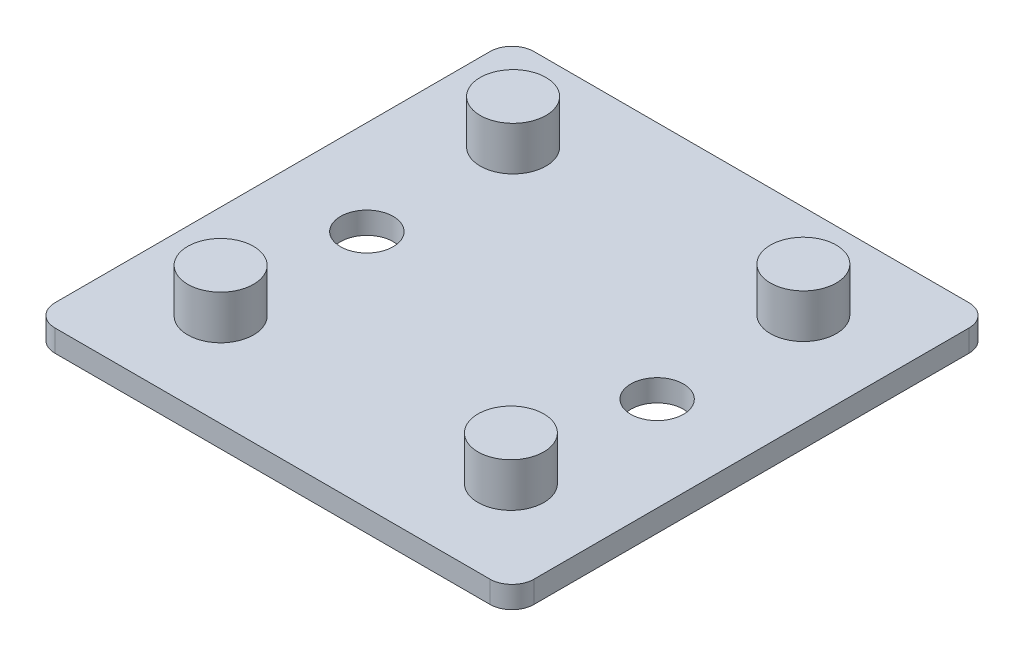
ISO-10303-21;
HEADER;
FILE_DESCRIPTION(('STEP AP214'),'2;1');
FILE_NAME('part.step','',(''),(''),'','','');
FILE_SCHEMA(('AUTOMOTIVE_DESIGN { 1 0 10303 214 1 1 1 1 }'));
ENDSEC;
DATA;
#1=APPLICATION_CONTEXT('core data for automotive mechanical design processes');
#2=APPLICATION_PROTOCOL_DEFINITION('international standard','automotive_design',2000,#1);
#3=PRODUCT_CONTEXT('',#1,'mechanical');
#4=PRODUCT('Part','Part','',(#3));
#5=PRODUCT_RELATED_PRODUCT_CATEGORY('part','',(#4));
#6=PRODUCT_DEFINITION_FORMATION('','',#4);
#7=PRODUCT_DEFINITION_CONTEXT('part definition',#1,'design');
#8=PRODUCT_DEFINITION('design','',#6,#7);
#9=PRODUCT_DEFINITION_SHAPE('','',#8);
#10=(LENGTH_UNIT() NAMED_UNIT(*) SI_UNIT(.MILLI.,.METRE.));
#11=(NAMED_UNIT(*) PLANE_ANGLE_UNIT() SI_UNIT($,.RADIAN.));
#12=(NAMED_UNIT(*) SI_UNIT($,.STERADIAN.) SOLID_ANGLE_UNIT());
#13=UNCERTAINTY_MEASURE_WITH_UNIT(LENGTH_MEASURE(1.E-05),#10,'distance_accuracy_value','');
#14=(GEOMETRIC_REPRESENTATION_CONTEXT(3) GLOBAL_UNCERTAINTY_ASSIGNED_CONTEXT((#13)) GLOBAL_UNIT_ASSIGNED_CONTEXT((#10,
#11,#12)) REPRESENTATION_CONTEXT('',''));
#15=CARTESIAN_POINT('',(0.,0.,0.));
#16=DIRECTION('',(0.,0.,1.));
#17=DIRECTION('',(1.,0.,0.));
#18=AXIS2_PLACEMENT_3D('',#15,#16,#17);
#19=CARTESIAN_POINT('',(-32.75,3.,32.75));
#20=DIRECTION('',(1.,0.,0.));
#21=DIRECTION('',(0.,0.,-1.));
#22=AXIS2_PLACEMENT_3D('',#19,#20,#21);
#23=PLANE('',#22);
#24=DIRECTION('',(0.,0.,1.));
#25=VECTOR('',#24,1.);
#26=CARTESIAN_POINT('',(-32.75,3.,32.75));
#27=LINE('',#26,#25);
#28=CARTESIAN_POINT('',(-32.75,3.,-29.75));
#29=VERTEX_POINT('',#28);
#30=CARTESIAN_POINT('',(-32.75,3.,29.75));
#31=VERTEX_POINT('',#30);
#32=EDGE_CURVE('E128',#29,#31,#27,.T.);
#33=ORIENTED_EDGE('',*,*,#32,.F.);
#34=DIRECTION('',(0.,-1.,0.));
#35=VECTOR('',#34,1.);
#36=CARTESIAN_POINT('',(-32.75,3.,-29.75));
#37=LINE('',#36,#35);
#38=CARTESIAN_POINT('',(-32.75,0.,-29.75));
#39=VERTEX_POINT('',#38);
#40=EDGE_CURVE('E112',#29,#39,#37,.T.);
#41=ORIENTED_EDGE('',*,*,#40,.T.);
#42=DIRECTION('',(0.,0.,1.));
#43=VECTOR('',#42,1.);
#44=CARTESIAN_POINT('',(-32.75,0.,32.75));
#45=LINE('',#44,#43);
#46=CARTESIAN_POINT('',(-32.75,0.,29.75));
#47=VERTEX_POINT('',#46);
#48=EDGE_CURVE('E125',#39,#47,#45,.T.);
#49=ORIENTED_EDGE('',*,*,#48,.T.);
#50=DIRECTION('',(0.,-1.,0.));
#51=VECTOR('',#50,1.);
#52=CARTESIAN_POINT('',(-32.75,3.,29.75));
#53=LINE('',#52,#51);
#54=EDGE_CURVE('E131',#47,#31,#53,.F.);
#55=ORIENTED_EDGE('',*,*,#54,.T.);
#56=EDGE_LOOP('',(#33,#41,#49,#55));
#57=FACE_BOUND('',#56,.T.);
#58=ADVANCED_FACE('F38',(#57),#23,.F.);
#59=CARTESIAN_POINT('',(32.75,3.,32.75));
#60=DIRECTION('',(0.,0.,-1.));
#61=DIRECTION('',(-1.,0.,0.));
#62=AXIS2_PLACEMENT_3D('',#59,#60,#61);
#63=PLANE('',#62);
#64=DIRECTION('',(1.,0.,0.));
#65=VECTOR('',#64,1.);
#66=CARTESIAN_POINT('',(32.75,3.,32.75));
#67=LINE('',#66,#65);
#68=CARTESIAN_POINT('',(-29.75,3.,32.75));
#69=VERTEX_POINT('',#68);
#70=CARTESIAN_POINT('',(29.75,3.,32.75));
#71=VERTEX_POINT('',#70);
#72=EDGE_CURVE('E214',#69,#71,#67,.T.);
#73=ORIENTED_EDGE('',*,*,#72,.F.);
#74=DIRECTION('',(0.,-1.,0.));
#75=VECTOR('',#74,1.);
#76=CARTESIAN_POINT('',(-29.75,3.,32.75));
#77=LINE('',#76,#75);
#78=CARTESIAN_POINT('',(-29.75,0.,32.75));
#79=VERTEX_POINT('',#78);
#80=EDGE_CURVE('E11',#69,#79,#77,.T.);
#81=ORIENTED_EDGE('',*,*,#80,.T.);
#82=DIRECTION('',(1.,0.,0.));
#83=VECTOR('',#82,1.);
#84=CARTESIAN_POINT('',(32.75,0.,32.75));
#85=LINE('',#84,#83);
#86=CARTESIAN_POINT('',(29.75,0.,32.75));
#87=VERTEX_POINT('',#86);
#88=EDGE_CURVE('E137',#79,#87,#85,.T.);
#89=ORIENTED_EDGE('',*,*,#88,.T.);
#90=DIRECTION('',(0.,-1.,0.));
#91=VECTOR('',#90,1.);
#92=CARTESIAN_POINT('',(29.75,3.,32.75));
#93=LINE('',#92,#91);
#94=EDGE_CURVE('E48',#87,#71,#93,.F.);
#95=ORIENTED_EDGE('',*,*,#94,.T.);
#96=EDGE_LOOP('',(#73,#81,#89,#95));
#97=FACE_BOUND('',#96,.T.);
#98=ADVANCED_FACE('F235',(#97),#63,.F.);
#99=CARTESIAN_POINT('',(32.75,3.,32.75));
#100=DIRECTION('',(-1.,0.,0.));
#101=DIRECTION('',(0.,0.,1.));
#102=AXIS2_PLACEMENT_3D('',#99,#100,#101);
#103=PLANE('',#102);
#104=DIRECTION('',(0.,0.,-1.));
#105=VECTOR('',#104,1.);
#106=CARTESIAN_POINT('',(32.75,0.,32.75));
#107=LINE('',#106,#105);
#108=CARTESIAN_POINT('',(32.75,0.,29.75));
#109=VERTEX_POINT('',#108);
#110=CARTESIAN_POINT('',(32.75,0.,-29.75));
#111=VERTEX_POINT('',#110);
#112=EDGE_CURVE('E143',#109,#111,#107,.T.);
#113=ORIENTED_EDGE('',*,*,#112,.T.);
#114=DIRECTION('',(0.,-1.,0.));
#115=VECTOR('',#114,1.);
#116=CARTESIAN_POINT('',(32.75,3.,-29.75));
#117=LINE('',#116,#115);
#118=CARTESIAN_POINT('',(32.75,3.,-29.75));
#119=VERTEX_POINT('',#118);
#120=EDGE_CURVE('E56',#111,#119,#117,.F.);
#121=ORIENTED_EDGE('',*,*,#120,.T.);
#122=DIRECTION('',(0.,0.,-1.));
#123=VECTOR('',#122,1.);
#124=CARTESIAN_POINT('',(32.75,3.,32.75));
#125=LINE('',#124,#123);
#126=CARTESIAN_POINT('',(32.75,3.,29.75));
#127=VERTEX_POINT('',#126);
#128=EDGE_CURVE('E216',#127,#119,#125,.T.);
#129=ORIENTED_EDGE('',*,*,#128,.F.);
#130=DIRECTION('',(0.,-1.,0.));
#131=VECTOR('',#130,1.);
#132=CARTESIAN_POINT('',(32.75,3.,29.75));
#133=LINE('',#132,#131);
#134=EDGE_CURVE('E181',#127,#109,#133,.T.);
#135=ORIENTED_EDGE('',*,*,#134,.T.);
#136=EDGE_LOOP('',(#113,#121,#129,#135));
#137=FACE_BOUND('',#136,.T.);
#138=ADVANCED_FACE('F229',(#137),#103,.F.);
#139=CARTESIAN_POINT('',(32.75,3.,-32.75));
#140=DIRECTION('',(0.,0.,1.));
#141=DIRECTION('',(1.,0.,0.));
#142=AXIS2_PLACEMENT_3D('',#139,#140,#141);
#143=PLANE('',#142);
#144=DIRECTION('',(-1.,0.,0.));
#145=VECTOR('',#144,1.);
#146=CARTESIAN_POINT('',(32.75,0.,-32.75));
#147=LINE('',#146,#145);
#148=CARTESIAN_POINT('',(29.75,0.,-32.75));
#149=VERTEX_POINT('',#148);
#150=CARTESIAN_POINT('',(-29.75,0.,-32.75));
#151=VERTEX_POINT('',#150);
#152=EDGE_CURVE('E154',#149,#151,#147,.T.);
#153=ORIENTED_EDGE('',*,*,#152,.T.);
#154=DIRECTION('',(0.,-1.,0.));
#155=VECTOR('',#154,1.);
#156=CARTESIAN_POINT('',(-29.75,3.,-32.75));
#157=LINE('',#156,#155);
#158=CARTESIAN_POINT('',(-29.75,3.,-32.75));
#159=VERTEX_POINT('',#158);
#160=EDGE_CURVE('E113',#151,#159,#157,.F.);
#161=ORIENTED_EDGE('',*,*,#160,.T.);
#162=DIRECTION('',(-1.,0.,0.));
#163=VECTOR('',#162,1.);
#164=CARTESIAN_POINT('',(32.75,3.,-32.75));
#165=LINE('',#164,#163);
#166=CARTESIAN_POINT('',(29.75,3.,-32.75));
#167=VERTEX_POINT('',#166);
#168=EDGE_CURVE('E149',#167,#159,#165,.T.);
#169=ORIENTED_EDGE('',*,*,#168,.F.);
#170=DIRECTION('',(0.,-1.,0.));
#171=VECTOR('',#170,1.);
#172=CARTESIAN_POINT('',(29.75,3.,-32.75));
#173=LINE('',#172,#171);
#174=EDGE_CURVE('E119',#167,#149,#173,.T.);
#175=ORIENTED_EDGE('',*,*,#174,.T.);
#176=EDGE_LOOP('',(#153,#161,#169,#175));
#177=FACE_BOUND('',#176,.T.);
#178=ADVANCED_FACE('F225',(#177),#143,.F.);
#179=CARTESIAN_POINT('',(0.,3.,0.));
#180=DIRECTION('',(0.,1.,0.));
#181=DIRECTION('',(0.,0.,1.));
#182=AXIS2_PLACEMENT_3D('',#179,#180,#181);
#183=PLANE('',#182);
#184=CARTESIAN_POINT('',(19.85,3.,0.));
#185=DIRECTION('',(0.,1.,0.));
#186=DIRECTION('',(0.,0.,1.));
#187=AXIS2_PLACEMENT_3D('',#184,#185,#186);
#188=CIRCLE('',#187,3.6);
#189=CARTESIAN_POINT('',(19.85,3.,3.6));
#190=VERTEX_POINT('',#189);
#191=EDGE_CURVE('E491',#190,#190,#188,.T.);
#192=ORIENTED_EDGE('',*,*,#191,.F.);
#193=EDGE_LOOP('',(#192));
#194=FACE_BOUND('',#193,.T.);
#195=CARTESIAN_POINT('',(-19.85,3.,0.));
#196=DIRECTION('',(0.,1.,0.));
#197=DIRECTION('',(0.,0.,1.));
#198=AXIS2_PLACEMENT_3D('',#195,#196,#197);
#199=CIRCLE('',#198,3.6);
#200=CARTESIAN_POINT('',(-19.85,3.,3.6));
#201=VERTEX_POINT('',#200);
#202=EDGE_CURVE('E495',#201,#201,#199,.T.);
#203=ORIENTED_EDGE('',*,*,#202,.F.);
#204=EDGE_LOOP('',(#203));
#205=FACE_BOUND('',#204,.T.);
#206=CARTESIAN_POINT('',(-19.85,3.,20.));
#207=DIRECTION('',(0.,1.,0.));
#208=DIRECTION('',(0.,0.,1.));
#209=AXIS2_PLACEMENT_3D('',#206,#207,#208);
#210=CIRCLE('',#209,4.5);
#211=CARTESIAN_POINT('',(-19.85,3.,24.5));
#212=VERTEX_POINT('',#211);
#213=EDGE_CURVE('E507',#212,#212,#210,.T.);
#214=ORIENTED_EDGE('',*,*,#213,.F.);
#215=EDGE_LOOP('',(#214));
#216=FACE_BOUND('',#215,.T.);
#217=CARTESIAN_POINT('',(-19.85,3.,-20.));
#218=DIRECTION('',(0.,1.,0.));
#219=DIRECTION('',(0.,0.,1.));
#220=AXIS2_PLACEMENT_3D('',#217,#218,#219);
#221=CIRCLE('',#220,4.5);
#222=CARTESIAN_POINT('',(-19.85,3.,-15.5));
#223=VERTEX_POINT('',#222);
#224=EDGE_CURVE('E512',#223,#223,#221,.T.);
#225=ORIENTED_EDGE('',*,*,#224,.F.);
#226=EDGE_LOOP('',(#225));
#227=FACE_BOUND('',#226,.T.);
#228=CARTESIAN_POINT('',(19.85,3.,-20.));
#229=DIRECTION('',(0.,1.,0.));
#230=DIRECTION('',(0.,0.,1.));
#231=AXIS2_PLACEMENT_3D('',#228,#229,#230);
#232=CIRCLE('',#231,4.5);
#233=CARTESIAN_POINT('',(19.85,3.,-15.5));
#234=VERTEX_POINT('',#233);
#235=EDGE_CURVE('E520',#234,#234,#232,.T.);
#236=ORIENTED_EDGE('',*,*,#235,.F.);
#237=EDGE_LOOP('',(#236));
#238=FACE_BOUND('',#237,.T.);
#239=CARTESIAN_POINT('',(19.85,3.,20.));
#240=DIRECTION('',(0.,1.,0.));
#241=DIRECTION('',(0.,0.,1.));
#242=AXIS2_PLACEMENT_3D('',#239,#240,#241);
#243=CIRCLE('',#242,4.5);
#244=CARTESIAN_POINT('',(19.85,3.,24.5));
#245=VERTEX_POINT('',#244);
#246=EDGE_CURVE('E535',#245,#245,#243,.T.);
#247=ORIENTED_EDGE('',*,*,#246,.F.);
#248=EDGE_LOOP('',(#247));
#249=FACE_BOUND('',#248,.T.);
#250=ORIENTED_EDGE('',*,*,#168,.T.);
#251=CARTESIAN_POINT('',(-29.75,3.,-29.75));
#252=DIRECTION('',(0.,1.,0.));
#253=DIRECTION('',(0.,0.,1.));
#254=AXIS2_PLACEMENT_3D('',#251,#252,#253);
#255=CIRCLE('',#254,3.);
#256=EDGE_CURVE('E178',#159,#29,#255,.T.);
#257=ORIENTED_EDGE('',*,*,#256,.T.);
#258=ORIENTED_EDGE('',*,*,#32,.T.);
#259=CARTESIAN_POINT('',(-29.75,3.,29.75));
#260=DIRECTION('',(0.,1.,0.));
#261=DIRECTION('',(0.,0.,1.));
#262=AXIS2_PLACEMENT_3D('',#259,#260,#261);
#263=CIRCLE('',#262,3.);
#264=EDGE_CURVE('E172',#31,#69,#263,.T.);
#265=ORIENTED_EDGE('',*,*,#264,.T.);
#266=ORIENTED_EDGE('',*,*,#72,.T.);
#267=CARTESIAN_POINT('',(29.75,3.,29.75));
#268=DIRECTION('',(0.,1.,0.));
#269=DIRECTION('',(0.,0.,1.));
#270=AXIS2_PLACEMENT_3D('',#267,#268,#269);
#271=CIRCLE('',#270,3.);
#272=EDGE_CURVE('E63',#71,#127,#271,.T.);
#273=ORIENTED_EDGE('',*,*,#272,.T.);
#274=ORIENTED_EDGE('',*,*,#128,.T.);
#275=CARTESIAN_POINT('',(29.75,3.,-29.75));
#276=DIRECTION('',(0.,1.,0.));
#277=DIRECTION('',(0.,0.,1.));
#278=AXIS2_PLACEMENT_3D('',#275,#276,#277);
#279=CIRCLE('',#278,3.);
#280=EDGE_CURVE('E175',#119,#167,#279,.T.);
#281=ORIENTED_EDGE('',*,*,#280,.T.);
#282=EDGE_LOOP('',(#250,#257,#258,#265,#266,#273,#274,#281));
#283=FACE_BOUND('',#282,.T.);
#284=ADVANCED_FACE('F222',(#194,#205,#216,#227,#238,#249,#283),#183,.T.);
#285=CARTESIAN_POINT('',(0.,0.,0.));
#286=DIRECTION('',(0.,1.,0.));
#287=DIRECTION('',(0.,0.,1.));
#288=AXIS2_PLACEMENT_3D('',#285,#286,#287);
#289=PLANE('',#288);
#290=CARTESIAN_POINT('',(19.85,0.,0.));
#291=DIRECTION('',(0.,1.,0.));
#292=DIRECTION('',(0.,0.,1.));
#293=AXIS2_PLACEMENT_3D('',#290,#291,#292);
#294=CIRCLE('',#293,3.6);
#295=CARTESIAN_POINT('',(19.85,0.,3.6));
#296=VERTEX_POINT('',#295);
#297=EDGE_CURVE('E493',#296,#296,#294,.T.);
#298=ORIENTED_EDGE('',*,*,#297,.T.);
#299=EDGE_LOOP('',(#298));
#300=FACE_BOUND('',#299,.T.);
#301=CARTESIAN_POINT('',(-19.85,0.,0.));
#302=DIRECTION('',(0.,1.,0.));
#303=DIRECTION('',(0.,0.,1.));
#304=AXIS2_PLACEMENT_3D('',#301,#302,#303);
#305=CIRCLE('',#304,3.6);
#306=CARTESIAN_POINT('',(-19.85,0.,3.6));
#307=VERTEX_POINT('',#306);
#308=EDGE_CURVE('E496',#307,#307,#305,.T.);
#309=ORIENTED_EDGE('',*,*,#308,.T.);
#310=EDGE_LOOP('',(#309));
#311=FACE_BOUND('',#310,.T.);
#312=CARTESIAN_POINT('',(-19.85,0.,20.));
#313=DIRECTION('',(0.,1.,0.));
#314=DIRECTION('',(0.,0.,1.));
#315=AXIS2_PLACEMENT_3D('',#312,#313,#314);
#316=CIRCLE('',#315,3.6);
#317=CARTESIAN_POINT('',(-19.85,0.,23.6));
#318=VERTEX_POINT('',#317);
#319=EDGE_CURVE('E42',#318,#318,#316,.F.);
#320=ORIENTED_EDGE('',*,*,#319,.F.);
#321=EDGE_LOOP('',(#320));
#322=FACE_BOUND('',#321,.T.);
#323=CARTESIAN_POINT('',(-19.85,0.,-20.));
#324=DIRECTION('',(0.,1.,0.));
#325=DIRECTION('',(0.,0.,1.));
#326=AXIS2_PLACEMENT_3D('',#323,#324,#325);
#327=CIRCLE('',#326,3.6);
#328=CARTESIAN_POINT('',(-19.85,0.,-16.4));
#329=VERTEX_POINT('',#328);
#330=EDGE_CURVE('E191',#329,#329,#327,.F.);
#331=ORIENTED_EDGE('',*,*,#330,.F.);
#332=EDGE_LOOP('',(#331));
#333=FACE_BOUND('',#332,.T.);
#334=CARTESIAN_POINT('',(19.85,0.,20.));
#335=DIRECTION('',(0.,1.,0.));
#336=DIRECTION('',(0.,0.,1.));
#337=AXIS2_PLACEMENT_3D('',#334,#335,#336);
#338=CIRCLE('',#337,3.6);
#339=CARTESIAN_POINT('',(19.85,0.,23.6));
#340=VERTEX_POINT('',#339);
#341=EDGE_CURVE('E138',#340,#340,#338,.T.);
#342=ORIENTED_EDGE('',*,*,#341,.T.);
#343=EDGE_LOOP('',(#342));
#344=FACE_BOUND('',#343,.T.);
#345=CARTESIAN_POINT('',(19.85,0.,-20.));
#346=DIRECTION('',(0.,1.,0.));
#347=DIRECTION('',(0.,0.,1.));
#348=AXIS2_PLACEMENT_3D('',#345,#346,#347);
#349=CIRCLE('',#348,3.6);
#350=CARTESIAN_POINT('',(19.85,0.,-16.4));
#351=VERTEX_POINT('',#350);
#352=EDGE_CURVE('E146',#351,#351,#349,.T.);
#353=ORIENTED_EDGE('',*,*,#352,.T.);
#354=EDGE_LOOP('',(#353));
#355=FACE_BOUND('',#354,.T.);
#356=ORIENTED_EDGE('',*,*,#48,.F.);
#357=CARTESIAN_POINT('',(-29.75,0.,-29.75));
#358=DIRECTION('',(0.,1.,0.));
#359=DIRECTION('',(0.,0.,1.));
#360=AXIS2_PLACEMENT_3D('',#357,#358,#359);
#361=CIRCLE('',#360,3.);
#362=EDGE_CURVE('E108',#39,#151,#361,.F.);
#363=ORIENTED_EDGE('',*,*,#362,.T.);
#364=ORIENTED_EDGE('',*,*,#152,.F.);
#365=CARTESIAN_POINT('',(29.75,0.,-29.75));
#366=DIRECTION('',(0.,1.,0.));
#367=DIRECTION('',(0.,0.,1.));
#368=AXIS2_PLACEMENT_3D('',#365,#366,#367);
#369=CIRCLE('',#368,3.);
#370=EDGE_CURVE('E120',#149,#111,#369,.F.);
#371=ORIENTED_EDGE('',*,*,#370,.T.);
#372=ORIENTED_EDGE('',*,*,#112,.F.);
#373=CARTESIAN_POINT('',(29.75,0.,29.75));
#374=DIRECTION('',(0.,1.,0.));
#375=DIRECTION('',(0.,0.,1.));
#376=AXIS2_PLACEMENT_3D('',#373,#374,#375);
#377=CIRCLE('',#376,3.);
#378=EDGE_CURVE('E130',#109,#87,#377,.F.);
#379=ORIENTED_EDGE('',*,*,#378,.T.);
#380=ORIENTED_EDGE('',*,*,#88,.F.);
#381=CARTESIAN_POINT('',(-29.75,0.,29.75));
#382=DIRECTION('',(0.,1.,0.));
#383=DIRECTION('',(0.,0.,1.));
#384=AXIS2_PLACEMENT_3D('',#381,#382,#383);
#385=CIRCLE('',#384,3.);
#386=EDGE_CURVE('E135',#79,#47,#385,.F.);
#387=ORIENTED_EDGE('',*,*,#386,.T.);
#388=EDGE_LOOP('',(#356,#363,#364,#371,#372,#379,#380,#387));
#389=FACE_BOUND('',#388,.T.);
#390=ADVANCED_FACE('F133',(#300,#311,#322,#333,#344,#355,#389),#289,.F.);
#391=CARTESIAN_POINT('',(-29.75,3.,-29.75));
#392=DIRECTION('',(0.,-1.,0.));
#393=DIRECTION('',(0.,0.,-1.));
#394=AXIS2_PLACEMENT_3D('',#391,#392,#393);
#395=CYLINDRICAL_SURFACE('',#394,3.);
#396=ORIENTED_EDGE('',*,*,#256,.F.);
#397=ORIENTED_EDGE('',*,*,#160,.F.);
#398=ORIENTED_EDGE('',*,*,#362,.F.);
#399=ORIENTED_EDGE('',*,*,#40,.F.);
#400=EDGE_LOOP('',(#396,#397,#398,#399));
#401=FACE_BOUND('',#400,.T.);
#402=ADVANCED_FACE('F111',(#401),#395,.T.);
#403=CARTESIAN_POINT('',(29.75,3.,-29.75));
#404=DIRECTION('',(0.,-1.,0.));
#405=DIRECTION('',(0.,0.,-1.));
#406=AXIS2_PLACEMENT_3D('',#403,#404,#405);
#407=CYLINDRICAL_SURFACE('',#406,3.);
#408=ORIENTED_EDGE('',*,*,#280,.F.);
#409=ORIENTED_EDGE('',*,*,#120,.F.);
#410=ORIENTED_EDGE('',*,*,#370,.F.);
#411=ORIENTED_EDGE('',*,*,#174,.F.);
#412=EDGE_LOOP('',(#408,#409,#410,#411));
#413=FACE_BOUND('',#412,.T.);
#414=ADVANCED_FACE('F227',(#413),#407,.T.);
#415=CARTESIAN_POINT('',(-29.75,3.,29.75));
#416=DIRECTION('',(0.,-1.,0.));
#417=DIRECTION('',(0.,0.,-1.));
#418=AXIS2_PLACEMENT_3D('',#415,#416,#417);
#419=CYLINDRICAL_SURFACE('',#418,3.);
#420=ORIENTED_EDGE('',*,*,#264,.F.);
#421=ORIENTED_EDGE('',*,*,#54,.F.);
#422=ORIENTED_EDGE('',*,*,#386,.F.);
#423=ORIENTED_EDGE('',*,*,#80,.F.);
#424=EDGE_LOOP('',(#420,#421,#422,#423));
#425=FACE_BOUND('',#424,.T.);
#426=ADVANCED_FACE('F239',(#425),#419,.T.);
#427=CARTESIAN_POINT('',(29.75,3.,29.75));
#428=DIRECTION('',(0.,-1.,0.));
#429=DIRECTION('',(0.,0.,-1.));
#430=AXIS2_PLACEMENT_3D('',#427,#428,#429);
#431=CYLINDRICAL_SURFACE('',#430,3.);
#432=ORIENTED_EDGE('',*,*,#272,.F.);
#433=ORIENTED_EDGE('',*,*,#94,.F.);
#434=ORIENTED_EDGE('',*,*,#378,.F.);
#435=ORIENTED_EDGE('',*,*,#134,.F.);
#436=EDGE_LOOP('',(#432,#433,#434,#435));
#437=FACE_BOUND('',#436,.T.);
#438=ADVANCED_FACE('F40',(#437),#431,.T.);
#439=CARTESIAN_POINT('',(19.85,-20.,-20.));
#440=DIRECTION('',(0.,1.,0.));
#441=DIRECTION('',(0.,0.,1.));
#442=AXIS2_PLACEMENT_3D('',#439,#440,#441);
#443=CYLINDRICAL_SURFACE('',#442,3.6);
#444=CARTESIAN_POINT('',(19.85,3.,-20.));
#445=DIRECTION('',(0.,1.,0.));
#446=DIRECTION('',(0.,0.,1.));
#447=AXIS2_PLACEMENT_3D('',#444,#445,#446);
#448=CIRCLE('',#447,3.6);
#449=CARTESIAN_POINT('',(19.85,3.,-16.4));
#450=VERTEX_POINT('',#449);
#451=EDGE_CURVE('E528',#450,#450,#448,.F.);
#452=ORIENTED_EDGE('',*,*,#451,.F.);
#453=EDGE_LOOP('',(#452));
#454=FACE_BOUND('',#453,.T.);
#455=ORIENTED_EDGE('',*,*,#352,.F.);
#456=EDGE_LOOP('',(#455));
#457=FACE_BOUND('',#456,.T.);
#458=ADVANCED_FACE('F245',(#454,#457),#443,.F.);
#459=CARTESIAN_POINT('',(19.85,-20.,20.));
#460=DIRECTION('',(0.,1.,0.));
#461=DIRECTION('',(0.,0.,1.));
#462=AXIS2_PLACEMENT_3D('',#459,#460,#461);
#463=CYLINDRICAL_SURFACE('',#462,3.6);
#464=CARTESIAN_POINT('',(19.85,3.,20.));
#465=DIRECTION('',(0.,1.,0.));
#466=DIRECTION('',(0.,0.,1.));
#467=AXIS2_PLACEMENT_3D('',#464,#465,#466);
#468=CIRCLE('',#467,3.6);
#469=CARTESIAN_POINT('',(19.85,3.,23.6));
#470=VERTEX_POINT('',#469);
#471=EDGE_CURVE('E207',#470,#470,#468,.F.);
#472=ORIENTED_EDGE('',*,*,#471,.F.);
#473=EDGE_LOOP('',(#472));
#474=FACE_BOUND('',#473,.T.);
#475=ORIENTED_EDGE('',*,*,#341,.F.);
#476=EDGE_LOOP('',(#475));
#477=FACE_BOUND('',#476,.T.);
#478=ADVANCED_FACE('F318',(#474,#477),#463,.F.);
#479=CARTESIAN_POINT('',(-19.85,-20.,-20.));
#480=DIRECTION('',(0.,1.,0.));
#481=DIRECTION('',(0.,0.,1.));
#482=AXIS2_PLACEMENT_3D('',#479,#480,#481);
#483=CYLINDRICAL_SURFACE('',#482,3.6);
#484=CARTESIAN_POINT('',(-19.85,3.,-20.));
#485=DIRECTION('',(0.,-1.,0.));
#486=DIRECTION('',(0.,0.,1.));
#487=AXIS2_PLACEMENT_3D('',#484,#485,#486);
#488=CIRCLE('',#487,3.6);
#489=CARTESIAN_POINT('',(-19.85,3.,-16.4));
#490=VERTEX_POINT('',#489);
#491=EDGE_CURVE('E201',#490,#490,#488,.T.);
#492=ORIENTED_EDGE('',*,*,#491,.F.);
#493=EDGE_LOOP('',(#492));
#494=FACE_BOUND('',#493,.T.);
#495=ORIENTED_EDGE('',*,*,#330,.T.);
#496=EDGE_LOOP('',(#495));
#497=FACE_BOUND('',#496,.T.);
#498=ADVANCED_FACE('F326',(#494,#497),#483,.F.);
#499=CARTESIAN_POINT('',(-19.85,-20.,20.));
#500=DIRECTION('',(0.,1.,0.));
#501=DIRECTION('',(0.,0.,1.));
#502=AXIS2_PLACEMENT_3D('',#499,#500,#501);
#503=CYLINDRICAL_SURFACE('',#502,3.6);
#504=CARTESIAN_POINT('',(-19.85,3.,20.));
#505=DIRECTION('',(0.,-1.,0.));
#506=DIRECTION('',(0.,0.,1.));
#507=AXIS2_PLACEMENT_3D('',#504,#505,#506);
#508=CIRCLE('',#507,3.6);
#509=CARTESIAN_POINT('',(-19.85,3.,23.6));
#510=VERTEX_POINT('',#509);
#511=EDGE_CURVE('E194',#510,#510,#508,.T.);
#512=ORIENTED_EDGE('',*,*,#511,.F.);
#513=EDGE_LOOP('',(#512));
#514=FACE_BOUND('',#513,.T.);
#515=ORIENTED_EDGE('',*,*,#319,.T.);
#516=EDGE_LOOP('',(#515));
#517=FACE_BOUND('',#516,.T.);
#518=ADVANCED_FACE('F335',(#514,#517),#503,.F.);
#519=CARTESIAN_POINT('',(19.85,3.,20.));
#520=DIRECTION('',(0.,1.,0.));
#521=DIRECTION('',(0.,0.,1.));
#522=AXIS2_PLACEMENT_3D('',#519,#520,#521);
#523=PLANE('',#522);
#524=ORIENTED_EDGE('',*,*,#471,.T.);
#525=EDGE_LOOP('',(#524));
#526=FACE_BOUND('',#525,.T.);
#527=ADVANCED_FACE('F344',(#526),#523,.F.);
#528=CARTESIAN_POINT('',(19.85,9.,20.));
#529=DIRECTION('',(0.,-1.,0.));
#530=DIRECTION('',(0.,0.,-1.));
#531=AXIS2_PLACEMENT_3D('',#528,#529,#530);
#532=CYLINDRICAL_SURFACE('',#531,4.5);
#533=CARTESIAN_POINT('',(19.85,9.,20.));
#534=DIRECTION('',(0.,1.,0.));
#535=DIRECTION('',(0.,0.,1.));
#536=AXIS2_PLACEMENT_3D('',#533,#534,#535);
#537=CIRCLE('',#536,4.5);
#538=CARTESIAN_POINT('',(19.85,9.,24.5));
#539=VERTEX_POINT('',#538);
#540=EDGE_CURVE('E536',#539,#539,#537,.T.);
#541=ORIENTED_EDGE('',*,*,#540,.F.);
#542=EDGE_LOOP('',(#541));
#543=FACE_BOUND('',#542,.T.);
#544=ORIENTED_EDGE('',*,*,#246,.T.);
#545=EDGE_LOOP('',(#544));
#546=FACE_BOUND('',#545,.T.);
#547=ADVANCED_FACE('F353',(#543,#546),#532,.T.);
#548=CARTESIAN_POINT('',(19.85,9.,20.));
#549=DIRECTION('',(0.,1.,0.));
#550=DIRECTION('',(0.,0.,1.));
#551=AXIS2_PLACEMENT_3D('',#548,#549,#550);
#552=PLANE('',#551);
#553=ORIENTED_EDGE('',*,*,#540,.T.);
#554=EDGE_LOOP('',(#553));
#555=FACE_BOUND('',#554,.T.);
#556=ADVANCED_FACE('F362',(#555),#552,.T.);
#557=CARTESIAN_POINT('',(19.85,3.,-20.));
#558=DIRECTION('',(0.,1.,0.));
#559=DIRECTION('',(0.,0.,1.));
#560=AXIS2_PLACEMENT_3D('',#557,#558,#559);
#561=PLANE('',#560);
#562=ORIENTED_EDGE('',*,*,#451,.T.);
#563=EDGE_LOOP('',(#562));
#564=FACE_BOUND('',#563,.T.);
#565=ADVANCED_FACE('F371',(#564),#561,.F.);
#566=CARTESIAN_POINT('',(19.85,9.,-20.));
#567=DIRECTION('',(0.,-1.,0.));
#568=DIRECTION('',(0.,0.,-1.));
#569=AXIS2_PLACEMENT_3D('',#566,#567,#568);
#570=CYLINDRICAL_SURFACE('',#569,4.5);
#571=CARTESIAN_POINT('',(19.85,9.,-20.));
#572=DIRECTION('',(0.,1.,0.));
#573=DIRECTION('',(0.,0.,1.));
#574=AXIS2_PLACEMENT_3D('',#571,#572,#573);
#575=CIRCLE('',#574,4.5);
#576=CARTESIAN_POINT('',(19.85,9.,-15.5));
#577=VERTEX_POINT('',#576);
#578=EDGE_CURVE('E524',#577,#577,#575,.T.);
#579=ORIENTED_EDGE('',*,*,#578,.F.);
#580=EDGE_LOOP('',(#579));
#581=FACE_BOUND('',#580,.T.);
#582=ORIENTED_EDGE('',*,*,#235,.T.);
#583=EDGE_LOOP('',(#582));
#584=FACE_BOUND('',#583,.T.);
#585=ADVANCED_FACE('F380',(#581,#584),#570,.T.);
#586=CARTESIAN_POINT('',(19.85,9.,-20.));
#587=DIRECTION('',(0.,1.,0.));
#588=DIRECTION('',(0.,0.,1.));
#589=AXIS2_PLACEMENT_3D('',#586,#587,#588);
#590=PLANE('',#589);
#591=ORIENTED_EDGE('',*,*,#578,.T.);
#592=EDGE_LOOP('',(#591));
#593=FACE_BOUND('',#592,.T.);
#594=ADVANCED_FACE('F389',(#593),#590,.T.);
#595=CARTESIAN_POINT('',(-19.85,3.,-20.));
#596=DIRECTION('',(0.,1.,0.));
#597=DIRECTION('',(0.,0.,1.));
#598=AXIS2_PLACEMENT_3D('',#595,#596,#597);
#599=PLANE('',#598);
#600=ORIENTED_EDGE('',*,*,#491,.T.);
#601=EDGE_LOOP('',(#600));
#602=FACE_BOUND('',#601,.T.);
#603=ADVANCED_FACE('F398',(#602),#599,.F.);
#604=CARTESIAN_POINT('',(-19.85,9.,-20.));
#605=DIRECTION('',(0.,-1.,0.));
#606=DIRECTION('',(0.,0.,-1.));
#607=AXIS2_PLACEMENT_3D('',#604,#605,#606);
#608=CYLINDRICAL_SURFACE('',#607,4.5);
#609=CARTESIAN_POINT('',(-19.85,9.,-20.));
#610=DIRECTION('',(0.,1.,0.));
#611=DIRECTION('',(0.,0.,1.));
#612=AXIS2_PLACEMENT_3D('',#609,#610,#611);
#613=CIRCLE('',#612,4.5);
#614=CARTESIAN_POINT('',(-19.85,9.,-15.5));
#615=VERTEX_POINT('',#614);
#616=EDGE_CURVE('E516',#615,#615,#613,.T.);
#617=ORIENTED_EDGE('',*,*,#616,.F.);
#618=EDGE_LOOP('',(#617));
#619=FACE_BOUND('',#618,.T.);
#620=ORIENTED_EDGE('',*,*,#224,.T.);
#621=EDGE_LOOP('',(#620));
#622=FACE_BOUND('',#621,.T.);
#623=ADVANCED_FACE('F407',(#619,#622),#608,.T.);
#624=CARTESIAN_POINT('',(-19.85,9.,-20.));
#625=DIRECTION('',(0.,1.,0.));
#626=DIRECTION('',(0.,0.,1.));
#627=AXIS2_PLACEMENT_3D('',#624,#625,#626);
#628=PLANE('',#627);
#629=ORIENTED_EDGE('',*,*,#616,.T.);
#630=EDGE_LOOP('',(#629));
#631=FACE_BOUND('',#630,.T.);
#632=ADVANCED_FACE('F416',(#631),#628,.T.);
#633=CARTESIAN_POINT('',(-19.85,3.,20.));
#634=DIRECTION('',(0.,1.,0.));
#635=DIRECTION('',(0.,0.,1.));
#636=AXIS2_PLACEMENT_3D('',#633,#634,#635);
#637=PLANE('',#636);
#638=ORIENTED_EDGE('',*,*,#511,.T.);
#639=EDGE_LOOP('',(#638));
#640=FACE_BOUND('',#639,.T.);
#641=ADVANCED_FACE('F425',(#640),#637,.F.);
#642=CARTESIAN_POINT('',(-19.85,9.,20.));
#643=DIRECTION('',(0.,-1.,0.));
#644=DIRECTION('',(0.,0.,-1.));
#645=AXIS2_PLACEMENT_3D('',#642,#643,#644);
#646=CYLINDRICAL_SURFACE('',#645,4.5);
#647=CARTESIAN_POINT('',(-19.85,9.,20.));
#648=DIRECTION('',(0.,1.,0.));
#649=DIRECTION('',(0.,0.,1.));
#650=AXIS2_PLACEMENT_3D('',#647,#648,#649);
#651=CIRCLE('',#650,4.5);
#652=CARTESIAN_POINT('',(-19.85,9.,24.5));
#653=VERTEX_POINT('',#652);
#654=EDGE_CURVE('E508',#653,#653,#651,.T.);
#655=ORIENTED_EDGE('',*,*,#654,.F.);
#656=EDGE_LOOP('',(#655));
#657=FACE_BOUND('',#656,.T.);
#658=ORIENTED_EDGE('',*,*,#213,.T.);
#659=EDGE_LOOP('',(#658));
#660=FACE_BOUND('',#659,.T.);
#661=ADVANCED_FACE('F434',(#657,#660),#646,.T.);
#662=CARTESIAN_POINT('',(-19.85,9.,20.));
#663=DIRECTION('',(0.,1.,0.));
#664=DIRECTION('',(0.,0.,1.));
#665=AXIS2_PLACEMENT_3D('',#662,#663,#664);
#666=PLANE('',#665);
#667=ORIENTED_EDGE('',*,*,#654,.T.);
#668=EDGE_LOOP('',(#667));
#669=FACE_BOUND('',#668,.T.);
#670=ADVANCED_FACE('F442',(#669),#666,.T.);
#671=CARTESIAN_POINT('',(-19.85,0.,0.));
#672=DIRECTION('',(0.,1.,0.));
#673=DIRECTION('',(0.,0.,1.));
#674=AXIS2_PLACEMENT_3D('',#671,#672,#673);
#675=CYLINDRICAL_SURFACE('',#674,3.6);
#676=ORIENTED_EDGE('',*,*,#202,.T.);
#677=EDGE_LOOP('',(#676));
#678=FACE_BOUND('',#677,.T.);
#679=ORIENTED_EDGE('',*,*,#308,.F.);
#680=EDGE_LOOP('',(#679));
#681=FACE_BOUND('',#680,.T.);
#682=ADVANCED_FACE('F450',(#678,#681),#675,.F.);
#683=CARTESIAN_POINT('',(19.85,0.,0.));
#684=DIRECTION('',(0.,1.,0.));
#685=DIRECTION('',(0.,0.,1.));
#686=AXIS2_PLACEMENT_3D('',#683,#684,#685);
#687=CYLINDRICAL_SURFACE('',#686,3.6);
#688=ORIENTED_EDGE('',*,*,#191,.T.);
#689=EDGE_LOOP('',(#688));
#690=FACE_BOUND('',#689,.T.);
#691=ORIENTED_EDGE('',*,*,#297,.F.);
#692=EDGE_LOOP('',(#691));
#693=FACE_BOUND('',#692,.T.);
#694=ADVANCED_FACE('F458',(#690,#693),#687,.F.);
#695=CLOSED_SHELL('',(#58,#98,#138,#178,#284,#390,#402,#414,#426,#438,#458,#478,#498,#518,#527,
#547,#556,#565,#585,#594,#603,#623,#632,#641,#661,#670,#682,#694));
#696=MANIFOLD_SOLID_BREP('B2',#695);
#697=ADVANCED_BREP_SHAPE_REPRESENTATION('',(#18,#696),#14);
#698=SHAPE_DEFINITION_REPRESENTATION(#9,#697);
ENDSEC;
END-ISO-10303-21;
